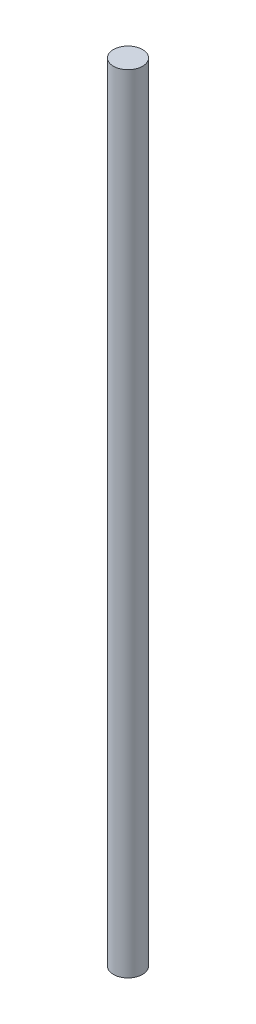
ISO-10303-21;
HEADER;
FILE_DESCRIPTION(('STEP AP214'),'2;1');
FILE_NAME('part.step','',(''),(''),'','','');
FILE_SCHEMA(('AUTOMOTIVE_DESIGN { 1 0 10303 214 1 1 1 1 }'));
ENDSEC;
DATA;
#1=APPLICATION_CONTEXT('core data for automotive mechanical design processes');
#2=APPLICATION_PROTOCOL_DEFINITION('international standard','automotive_design',2000,#1);
#3=PRODUCT_CONTEXT('',#1,'mechanical');
#4=PRODUCT('Part','Part','',(#3));
#5=PRODUCT_RELATED_PRODUCT_CATEGORY('part','',(#4));
#6=PRODUCT_DEFINITION_FORMATION('','',#4);
#7=PRODUCT_DEFINITION_CONTEXT('part definition',#1,'design');
#8=PRODUCT_DEFINITION('design','',#6,#7);
#9=PRODUCT_DEFINITION_SHAPE('','',#8);
#10=(LENGTH_UNIT() NAMED_UNIT(*) SI_UNIT(.MILLI.,.METRE.));
#11=(NAMED_UNIT(*) PLANE_ANGLE_UNIT() SI_UNIT($,.RADIAN.));
#12=(NAMED_UNIT(*) SI_UNIT($,.STERADIAN.) SOLID_ANGLE_UNIT());
#13=UNCERTAINTY_MEASURE_WITH_UNIT(LENGTH_MEASURE(1.E-05),#10,'distance_accuracy_value','');
#14=(GEOMETRIC_REPRESENTATION_CONTEXT(3) GLOBAL_UNCERTAINTY_ASSIGNED_CONTEXT((#13)) GLOBAL_UNIT_ASSIGNED_CONTEXT((#10,
#11,#12)) REPRESENTATION_CONTEXT('',''));
#15=CARTESIAN_POINT('',(0.,0.,0.));
#16=DIRECTION('',(0.,0.,1.));
#17=DIRECTION('',(1.,0.,0.));
#18=AXIS2_PLACEMENT_3D('',#15,#16,#17);
#19=CARTESIAN_POINT('',(0.,257.81,0.));
#20=DIRECTION('',(0.,-1.,0.));
#21=DIRECTION('',(0.,0.,-1.));
#22=AXIS2_PLACEMENT_3D('',#19,#20,#21);
#23=CYLINDRICAL_SURFACE('',#22,4.7625);
#24=CARTESIAN_POINT('',(0.,257.81,0.));
#25=DIRECTION('',(0.,1.,0.));
#26=DIRECTION('',(0.,0.,1.));
#27=AXIS2_PLACEMENT_3D('',#24,#25,#26);
#28=CIRCLE('',#27,4.7625);
#29=CARTESIAN_POINT('',(0.,257.81,4.7625));
#30=VERTEX_POINT('',#29);
#31=EDGE_CURVE('E10',#30,#30,#28,.T.);
#32=ORIENTED_EDGE('',*,*,#31,.F.);
#33=EDGE_LOOP('',(#32));
#34=FACE_BOUND('',#33,.T.);
#35=CARTESIAN_POINT('',(0.,0.,0.));
#36=DIRECTION('',(0.,1.,0.));
#37=DIRECTION('',(0.,0.,1.));
#38=AXIS2_PLACEMENT_3D('',#35,#36,#37);
#39=CIRCLE('',#38,4.7625);
#40=CARTESIAN_POINT('',(0.,0.,4.7625));
#41=VERTEX_POINT('',#40);
#42=EDGE_CURVE('E40',#41,#41,#39,.T.);
#43=ORIENTED_EDGE('',*,*,#42,.T.);
#44=EDGE_LOOP('',(#43));
#45=FACE_BOUND('',#44,.T.);
#46=ADVANCED_FACE('F37',(#34,#45),#23,.T.);
#47=CARTESIAN_POINT('',(0.,257.81,0.));
#48=DIRECTION('',(0.,1.,0.));
#49=DIRECTION('',(0.,0.,1.));
#50=AXIS2_PLACEMENT_3D('',#47,#48,#49);
#51=PLANE('',#50);
#52=ORIENTED_EDGE('',*,*,#31,.T.);
#53=EDGE_LOOP('',(#52));
#54=FACE_BOUND('',#53,.T.);
#55=ADVANCED_FACE('F52',(#54),#51,.T.);
#56=CARTESIAN_POINT('',(0.,0.,0.));
#57=DIRECTION('',(0.,1.,0.));
#58=DIRECTION('',(0.,0.,1.));
#59=AXIS2_PLACEMENT_3D('',#56,#57,#58);
#60=PLANE('',#59);
#61=ORIENTED_EDGE('',*,*,#42,.F.);
#62=EDGE_LOOP('',(#61));
#63=FACE_BOUND('',#62,.T.);
#64=ADVANCED_FACE('F50',(#63),#60,.F.);
#65=CLOSED_SHELL('',(#46,#55,#64));
#66=MANIFOLD_SOLID_BREP('B2',#65);
#67=ADVANCED_BREP_SHAPE_REPRESENTATION('',(#18,#66),#14);
#68=SHAPE_DEFINITION_REPRESENTATION(#9,#67);
ENDSEC;
END-ISO-10303-21;
